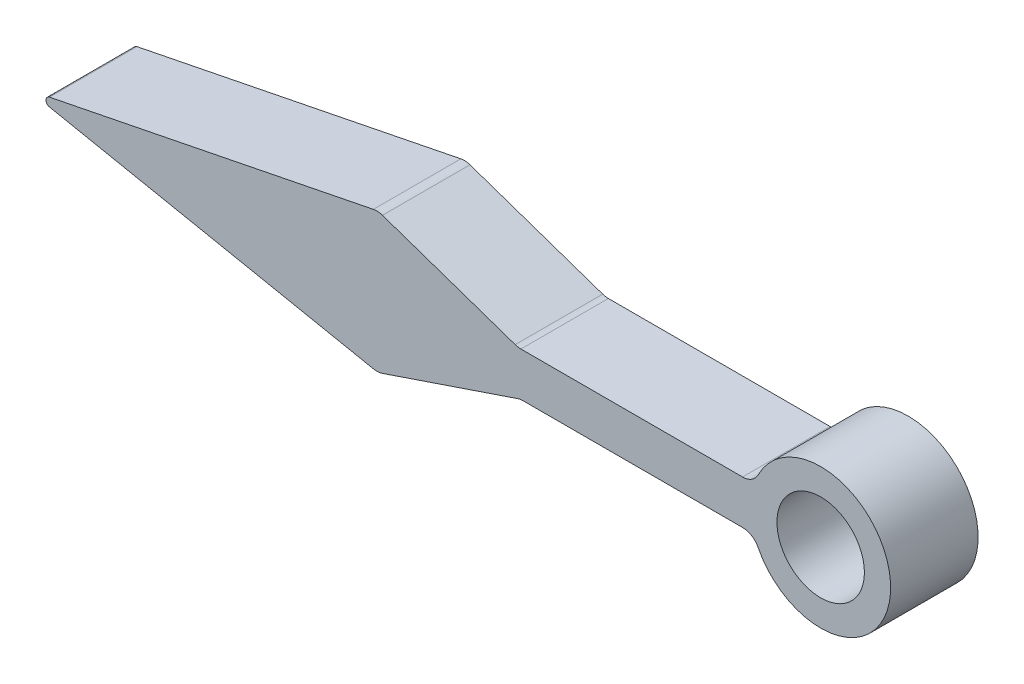
ISO-10303-21;
HEADER;
FILE_DESCRIPTION(('STEP AP214'),'2;1');
FILE_NAME('part.step','',(''),(''),'','','');
FILE_SCHEMA(('AUTOMOTIVE_DESIGN { 1 0 10303 214 1 1 1 1 }'));
ENDSEC;
DATA;
#1=APPLICATION_CONTEXT('core data for automotive mechanical design processes');
#2=APPLICATION_PROTOCOL_DEFINITION('international standard','automotive_design',2000,#1);
#3=PRODUCT_CONTEXT('',#1,'mechanical');
#4=PRODUCT('Part','Part','',(#3));
#5=PRODUCT_RELATED_PRODUCT_CATEGORY('part','',(#4));
#6=PRODUCT_DEFINITION_FORMATION('','',#4);
#7=PRODUCT_DEFINITION_CONTEXT('part definition',#1,'design');
#8=PRODUCT_DEFINITION('design','',#6,#7);
#9=PRODUCT_DEFINITION_SHAPE('','',#8);
#10=(LENGTH_UNIT() NAMED_UNIT(*) SI_UNIT(.MILLI.,.METRE.));
#11=(NAMED_UNIT(*) PLANE_ANGLE_UNIT() SI_UNIT($,.RADIAN.));
#12=(NAMED_UNIT(*) SI_UNIT($,.STERADIAN.) SOLID_ANGLE_UNIT());
#13=UNCERTAINTY_MEASURE_WITH_UNIT(LENGTH_MEASURE(1.E-05),#10,'distance_accuracy_value','');
#14=(GEOMETRIC_REPRESENTATION_CONTEXT(3) GLOBAL_UNCERTAINTY_ASSIGNED_CONTEXT((#13)) GLOBAL_UNIT_ASSIGNED_CONTEXT((#10,
#11,#12)) REPRESENTATION_CONTEXT('',''));
#15=CARTESIAN_POINT('',(0.,0.,0.));
#16=DIRECTION('',(0.,0.,1.));
#17=DIRECTION('',(1.,0.,0.));
#18=AXIS2_PLACEMENT_3D('',#15,#16,#17);
#19=CARTESIAN_POINT('',(0.,0.,5.));
#20=DIRECTION('',(0.,0.,-1.));
#21=DIRECTION('',(-1.,0.,0.));
#22=AXIS2_PLACEMENT_3D('',#19,#20,#21);
#23=PLANE('',#22);
#24=DIRECTION('',(-0.98058067569092,-0.196116135138184,0.));
#25=VECTOR('',#24,1.);
#26=CARTESIAN_POINT('',(-25.2996710383927,4.,5.));
#27=LINE('',#26,#25);
#28=CARTESIAN_POINT('',(-25.5649896875759,3.94693627016336,5.));
#29=VERTEX_POINT('',#28);
#30=CARTESIAN_POINT('',(-44.073945193779,0.245145168922732,5.));
#31=VERTEX_POINT('',#30);
#32=EDGE_CURVE('E194',#29,#31,#27,.T.);
#33=ORIENTED_EDGE('',*,*,#32,.T.);
#34=CARTESIAN_POINT('',(-44.0249161599945,0.,5.));
#35=DIRECTION('',(0.,0.,-1.));
#36=DIRECTION('',(-1.,0.,0.));
#37=AXIS2_PLACEMENT_3D('',#34,#35,#36);
#38=CIRCLE('',#37,0.25);
#39=CARTESIAN_POINT('',(-44.073945193779,-0.245145168922731,5.));
#40=VERTEX_POINT('',#39);
#41=EDGE_CURVE('E12',#31,#40,#38,.F.);
#42=ORIENTED_EDGE('',*,*,#41,.T.);
#43=DIRECTION('',(0.98058067569092,-0.196116135138184,0.));
#44=VECTOR('',#43,1.);
#45=CARTESIAN_POINT('',(-45.2996710383927,0.,5.));
#46=LINE('',#45,#44);
#47=CARTESIAN_POINT('',(-25.5624168385576,-3.94745083996701,5.));
#48=VERTEX_POINT('',#47);
#49=EDGE_CURVE('E192',#40,#48,#46,.T.);
#50=ORIENTED_EDGE('',*,*,#49,.T.);
#51=CARTESIAN_POINT('',(-25.3663007034194,-2.96687016427609,5.));
#52=DIRECTION('',(0.,0.,-1.));
#53=DIRECTION('',(-1.,0.,0.));
#54=AXIS2_PLACEMENT_3D('',#51,#52,#53);
#55=CIRCLE('',#54,1.);
#56=CARTESIAN_POINT('',(-25.0458519206957,-3.91413600745363,5.));
#57=VERTEX_POINT('',#56);
#58=EDGE_CURVE('E222',#48,#57,#55,.F.);
#59=ORIENTED_EDGE('',*,*,#58,.T.);
#60=DIRECTION('',(0.947265843177538,0.320448782723772,0.));
#61=VECTOR('',#60,1.);
#62=CARTESIAN_POINT('',(-25.2996710383927,-4.,5.));
#63=LINE('',#62,#61);
#64=CARTESIAN_POINT('',(-17.3263912477998,-1.30273415682246,5.));
#65=VERTEX_POINT('',#64);
#66=EDGE_CURVE('E299',#57,#65,#63,.T.);
#67=ORIENTED_EDGE('',*,*,#66,.T.);
#68=CARTESIAN_POINT('',(-17.005942465076,-2.25,5.));
#69=DIRECTION('',(0.,0.,-1.));
#70=DIRECTION('',(-1.,0.,0.));
#71=AXIS2_PLACEMENT_3D('',#68,#69,#70);
#72=CIRCLE('',#71,1.);
#73=CARTESIAN_POINT('',(-17.005942465076,-1.25,5.));
#74=VERTEX_POINT('',#73);
#75=EDGE_CURVE('E291',#65,#74,#72,.T.);
#76=ORIENTED_EDGE('',*,*,#75,.T.);
#77=DIRECTION('',(1.,0.,0.));
#78=VECTOR('',#77,1.);
#79=CARTESIAN_POINT('',(-17.1705059137938,-1.25,5.));
#80=LINE('',#79,#78);
#81=CARTESIAN_POINT('',(-4.46514277487294,-1.25,5.));
#82=VERTEX_POINT('',#81);
#83=EDGE_CURVE('E260',#74,#82,#80,.T.);
#84=ORIENTED_EDGE('',*,*,#83,.T.);
#85=CARTESIAN_POINT('',(-4.46514277487294,-2.25,5.));
#86=DIRECTION('',(0.,0.,-1.));
#87=DIRECTION('',(-1.,0.,0.));
#88=AXIS2_PLACEMENT_3D('',#85,#86,#87);
#89=CIRCLE('',#88,1.);
#90=CARTESIAN_POINT('',(-3.57211421989835,-1.8,5.));
#91=VERTEX_POINT('',#90);
#92=EDGE_CURVE('E154',#82,#91,#89,.T.);
#93=ORIENTED_EDGE('',*,*,#92,.T.);
#94=CARTESIAN_POINT('',(0.,0.,5.));
#95=DIRECTION('',(0.,0.,1.));
#96=DIRECTION('',(-1.,0.,0.));
#97=AXIS2_PLACEMENT_3D('',#94,#95,#96);
#98=CIRCLE('',#97,4.);
#99=CARTESIAN_POINT('',(-3.57211421989835,1.8,5.));
#100=VERTEX_POINT('',#99);
#101=EDGE_CURVE('E164',#91,#100,#98,.T.);
#102=ORIENTED_EDGE('',*,*,#101,.T.);
#103=CARTESIAN_POINT('',(-4.46514277487294,2.25,5.));
#104=DIRECTION('',(0.,0.,-1.));
#105=DIRECTION('',(-1.,0.,0.));
#106=AXIS2_PLACEMENT_3D('',#103,#104,#105);
#107=CIRCLE('',#106,1.);
#108=CARTESIAN_POINT('',(-4.46514277487294,1.25,5.));
#109=VERTEX_POINT('',#108);
#110=EDGE_CURVE('E279',#100,#109,#107,.T.);
#111=ORIENTED_EDGE('',*,*,#110,.T.);
#112=DIRECTION('',(-1.,0.,0.));
#113=VECTOR('',#112,1.);
#114=CARTESIAN_POINT('',(-3.79967103839267,1.25,5.));
#115=LINE('',#114,#113);
#116=CARTESIAN_POINT('',(-17.1325938900856,1.25,5.));
#117=VERTEX_POINT('',#116);
#118=EDGE_CURVE('E259',#109,#117,#115,.T.);
#119=ORIENTED_EDGE('',*,*,#118,.T.);
#120=CARTESIAN_POINT('',(-17.1325938900856,2.25,5.));
#121=DIRECTION('',(0.,0.,-1.));
#122=DIRECTION('',(-1.,0.,0.));
#123=AXIS2_PLACEMENT_3D('',#120,#121,#122);
#124=CIRCLE('',#123,1.);
#125=CARTESIAN_POINT('',(-17.4576736585967,1.30431340069513,5.));
#126=VERTEX_POINT('',#125);
#127=EDGE_CURVE('E272',#117,#126,#124,.T.);
#128=ORIENTED_EDGE('',*,*,#127,.T.);
#129=DIRECTION('',(-0.945686599304867,0.325079768511048,0.));
#130=VECTOR('',#129,1.);
#131=CARTESIAN_POINT('',(-17.2996710383927,1.25,5.));
#132=LINE('',#131,#130);
#133=CARTESIAN_POINT('',(-25.0437937839266,3.9120421937773,5.));
#134=VERTEX_POINT('',#133);
#135=EDGE_CURVE('E267',#126,#134,#132,.T.);
#136=ORIENTED_EDGE('',*,*,#135,.T.);
#137=CARTESIAN_POINT('',(-25.3688735524377,2.96635559447244,5.));
#138=DIRECTION('',(0.,0.,-1.));
#139=DIRECTION('',(-1.,0.,0.));
#140=AXIS2_PLACEMENT_3D('',#137,#138,#139);
#141=CIRCLE('',#140,1.);
#142=EDGE_CURVE('E219',#134,#29,#141,.F.);
#143=ORIENTED_EDGE('',*,*,#142,.T.);
#144=EDGE_LOOP('',(#33,#42,#50,#59,#67,#76,#84,#93,#102,#111,#119,#128,#136,#143));
#145=FACE_BOUND('',#144,.T.);
#146=CARTESIAN_POINT('',(0.,0.,5.));
#147=DIRECTION('',(0.,0.,1.));
#148=DIRECTION('',(1.,0.,0.));
#149=AXIS2_PLACEMENT_3D('',#146,#147,#148);
#150=CIRCLE('',#149,2.5);
#151=CARTESIAN_POINT('',(2.5,0.,5.));
#152=VERTEX_POINT('',#151);
#153=EDGE_CURVE('E317',#152,#152,#150,.T.);
#154=ORIENTED_EDGE('',*,*,#153,.F.);
#155=EDGE_LOOP('',(#154));
#156=FACE_BOUND('',#155,.T.);
#157=ADVANCED_FACE('F42',(#145,#156),#23,.F.);
#158=CARTESIAN_POINT('',(0.,0.,0.));
#159=DIRECTION('',(0.,0.,-1.));
#160=DIRECTION('',(-1.,0.,0.));
#161=AXIS2_PLACEMENT_3D('',#158,#159,#160);
#162=PLANE('',#161);
#163=DIRECTION('',(0.98058067569092,-0.196116135138184,0.));
#164=VECTOR('',#163,1.);
#165=CARTESIAN_POINT('',(-45.2996710383927,0.,0.));
#166=LINE('',#165,#164);
#167=CARTESIAN_POINT('',(-44.073945193779,-0.245145168922731,0.));
#168=VERTEX_POINT('',#167);
#169=CARTESIAN_POINT('',(-25.5624168385576,-3.94745083996701,0.));
#170=VERTEX_POINT('',#169);
#171=EDGE_CURVE('E315',#168,#170,#166,.T.);
#172=ORIENTED_EDGE('',*,*,#171,.F.);
#173=CARTESIAN_POINT('',(-44.0249161599945,0.,0.));
#174=DIRECTION('',(0.,0.,-1.));
#175=DIRECTION('',(-1.,0.,0.));
#176=AXIS2_PLACEMENT_3D('',#173,#174,#175);
#177=CIRCLE('',#176,0.25);
#178=CARTESIAN_POINT('',(-44.073945193779,0.245145168922732,0.));
#179=VERTEX_POINT('',#178);
#180=EDGE_CURVE('E65',#168,#179,#177,.T.);
#181=ORIENTED_EDGE('',*,*,#180,.T.);
#182=DIRECTION('',(-0.98058067569092,-0.196116135138184,0.));
#183=VECTOR('',#182,1.);
#184=CARTESIAN_POINT('',(-25.2996710383927,4.,0.));
#185=LINE('',#184,#183);
#186=CARTESIAN_POINT('',(-25.5649896875759,3.94693627016336,0.));
#187=VERTEX_POINT('',#186);
#188=EDGE_CURVE('E189',#187,#179,#185,.T.);
#189=ORIENTED_EDGE('',*,*,#188,.F.);
#190=CARTESIAN_POINT('',(-25.3688735524377,2.96635559447244,0.));
#191=DIRECTION('',(0.,0.,-1.));
#192=DIRECTION('',(-1.,0.,0.));
#193=AXIS2_PLACEMENT_3D('',#190,#191,#192);
#194=CIRCLE('',#193,1.);
#195=CARTESIAN_POINT('',(-25.0437937839266,3.9120421937773,0.));
#196=VERTEX_POINT('',#195);
#197=EDGE_CURVE('E208',#187,#196,#194,.T.);
#198=ORIENTED_EDGE('',*,*,#197,.T.);
#199=DIRECTION('',(-0.945686599304867,0.325079768511048,0.));
#200=VECTOR('',#199,1.);
#201=CARTESIAN_POINT('',(-17.2996710383927,1.25,0.));
#202=LINE('',#201,#200);
#203=CARTESIAN_POINT('',(-17.4576736585967,1.30431340069513,0.));
#204=VERTEX_POINT('',#203);
#205=EDGE_CURVE('E180',#204,#196,#202,.T.);
#206=ORIENTED_EDGE('',*,*,#205,.F.);
#207=CARTESIAN_POINT('',(-17.1325938900856,2.25,0.));
#208=DIRECTION('',(0.,0.,-1.));
#209=DIRECTION('',(-1.,0.,0.));
#210=AXIS2_PLACEMENT_3D('',#207,#208,#209);
#211=CIRCLE('',#210,1.);
#212=CARTESIAN_POINT('',(-17.1325938900856,1.25,0.));
#213=VERTEX_POINT('',#212);
#214=EDGE_CURVE('E277',#204,#213,#211,.F.);
#215=ORIENTED_EDGE('',*,*,#214,.T.);
#216=DIRECTION('',(-1.,0.,0.));
#217=VECTOR('',#216,1.);
#218=CARTESIAN_POINT('',(-3.79967103839267,1.25,0.));
#219=LINE('',#218,#217);
#220=CARTESIAN_POINT('',(-4.46514277487294,1.25,0.));
#221=VERTEX_POINT('',#220);
#222=EDGE_CURVE('E174',#221,#213,#219,.T.);
#223=ORIENTED_EDGE('',*,*,#222,.F.);
#224=CARTESIAN_POINT('',(-4.46514277487294,2.25,0.));
#225=DIRECTION('',(0.,0.,-1.));
#226=DIRECTION('',(-1.,0.,0.));
#227=AXIS2_PLACEMENT_3D('',#224,#225,#226);
#228=CIRCLE('',#227,1.);
#229=CARTESIAN_POINT('',(-3.57211421989835,1.8,0.));
#230=VERTEX_POINT('',#229);
#231=EDGE_CURVE('E172',#221,#230,#228,.F.);
#232=ORIENTED_EDGE('',*,*,#231,.T.);
#233=CARTESIAN_POINT('',(0.,0.,0.));
#234=DIRECTION('',(0.,0.,1.));
#235=DIRECTION('',(-1.,0.,0.));
#236=AXIS2_PLACEMENT_3D('',#233,#234,#235);
#237=CIRCLE('',#236,4.);
#238=CARTESIAN_POINT('',(-3.57211421989835,-1.8,0.));
#239=VERTEX_POINT('',#238);
#240=EDGE_CURVE('E161',#239,#230,#237,.T.);
#241=ORIENTED_EDGE('',*,*,#240,.F.);
#242=CARTESIAN_POINT('',(-4.46514277487294,-2.25,0.));
#243=DIRECTION('',(0.,0.,-1.));
#244=DIRECTION('',(-1.,0.,0.));
#245=AXIS2_PLACEMENT_3D('',#242,#243,#244);
#246=CIRCLE('',#245,1.);
#247=CARTESIAN_POINT('',(-4.46514277487294,-1.25,0.));
#248=VERTEX_POINT('',#247);
#249=EDGE_CURVE('E144',#239,#248,#246,.F.);
#250=ORIENTED_EDGE('',*,*,#249,.T.);
#251=DIRECTION('',(1.,0.,0.));
#252=VECTOR('',#251,1.);
#253=CARTESIAN_POINT('',(-17.1705059137938,-1.25,0.));
#254=LINE('',#253,#252);
#255=CARTESIAN_POINT('',(-17.005942465076,-1.25,0.));
#256=VERTEX_POINT('',#255);
#257=EDGE_CURVE('E175',#256,#248,#254,.T.);
#258=ORIENTED_EDGE('',*,*,#257,.F.);
#259=CARTESIAN_POINT('',(-17.005942465076,-2.25,0.));
#260=DIRECTION('',(0.,0.,-1.));
#261=DIRECTION('',(-1.,0.,0.));
#262=AXIS2_PLACEMENT_3D('',#259,#260,#261);
#263=CIRCLE('',#262,1.);
#264=CARTESIAN_POINT('',(-17.3263912477998,-1.30273415682246,0.));
#265=VERTEX_POINT('',#264);
#266=EDGE_CURVE('E245',#256,#265,#263,.F.);
#267=ORIENTED_EDGE('',*,*,#266,.T.);
#268=DIRECTION('',(0.947265843177538,0.320448782723772,0.));
#269=VECTOR('',#268,1.);
#270=CARTESIAN_POINT('',(-25.2996710383927,-4.,0.));
#271=LINE('',#270,#269);
#272=CARTESIAN_POINT('',(-25.0458519206957,-3.91413600745363,0.));
#273=VERTEX_POINT('',#272);
#274=EDGE_CURVE('E182',#273,#265,#271,.T.);
#275=ORIENTED_EDGE('',*,*,#274,.F.);
#276=CARTESIAN_POINT('',(-25.3663007034194,-2.96687016427609,0.));
#277=DIRECTION('',(0.,0.,-1.));
#278=DIRECTION('',(-1.,0.,0.));
#279=AXIS2_PLACEMENT_3D('',#276,#277,#278);
#280=CIRCLE('',#279,1.);
#281=EDGE_CURVE('E211',#273,#170,#280,.T.);
#282=ORIENTED_EDGE('',*,*,#281,.T.);
#283=EDGE_LOOP('',(#172,#181,#189,#198,#206,#215,#223,#232,#241,#250,#258,#267,#275,#282));
#284=FACE_BOUND('',#283,.T.);
#285=CARTESIAN_POINT('',(0.,0.,0.));
#286=DIRECTION('',(0.,0.,1.));
#287=DIRECTION('',(1.,0.,0.));
#288=AXIS2_PLACEMENT_3D('',#285,#286,#287);
#289=CIRCLE('',#288,2.5);
#290=CARTESIAN_POINT('',(2.5,0.,0.));
#291=VERTEX_POINT('',#290);
#292=EDGE_CURVE('E307',#291,#291,#289,.T.);
#293=ORIENTED_EDGE('',*,*,#292,.T.);
#294=EDGE_LOOP('',(#293));
#295=FACE_BOUND('',#294,.T.);
#296=ADVANCED_FACE('F169',(#284,#295),#162,.T.);
#297=CARTESIAN_POINT('',(-45.2996710383927,0.,5.));
#298=DIRECTION('',(0.196116135138184,0.98058067569092,0.));
#299=DIRECTION('',(-0.98058067569092,0.196116135138184,0.));
#300=AXIS2_PLACEMENT_3D('',#297,#298,#299);
#301=PLANE('',#300);
#302=ORIENTED_EDGE('',*,*,#49,.F.);
#303=DIRECTION('',(0.,0.,-1.));
#304=VECTOR('',#303,1.);
#305=CARTESIAN_POINT('',(-44.073945193779,-0.245145168922731,5.));
#306=LINE('',#305,#304);
#307=EDGE_CURVE('E283',#40,#168,#306,.T.);
#308=ORIENTED_EDGE('',*,*,#307,.T.);
#309=ORIENTED_EDGE('',*,*,#171,.T.);
#310=DIRECTION('',(0.,0.,-1.));
#311=VECTOR('',#310,1.);
#312=CARTESIAN_POINT('',(-25.5624168385576,-3.94745083996701,5.));
#313=LINE('',#312,#311);
#314=EDGE_CURVE('E215',#170,#48,#313,.F.);
#315=ORIENTED_EDGE('',*,*,#314,.T.);
#316=EDGE_LOOP('',(#302,#308,#309,#315));
#317=FACE_BOUND('',#316,.T.);
#318=ADVANCED_FACE('F342',(#317),#301,.F.);
#319=CARTESIAN_POINT('',(-25.2996710383927,-4.,5.));
#320=DIRECTION('',(-0.320448782723772,0.947265843177538,0.));
#321=DIRECTION('',(-0.947265843177538,-0.320448782723772,0.));
#322=AXIS2_PLACEMENT_3D('',#319,#320,#321);
#323=PLANE('',#322);
#324=ORIENTED_EDGE('',*,*,#274,.T.);
#325=DIRECTION('',(0.,0.,-1.));
#326=VECTOR('',#325,1.);
#327=CARTESIAN_POINT('',(-17.3263912477998,-1.30273415682246,5.));
#328=LINE('',#327,#326);
#329=EDGE_CURVE('E205',#265,#65,#328,.F.);
#330=ORIENTED_EDGE('',*,*,#329,.T.);
#331=ORIENTED_EDGE('',*,*,#66,.F.);
#332=DIRECTION('',(0.,0.,-1.));
#333=VECTOR('',#332,1.);
#334=CARTESIAN_POINT('',(-25.0458519206957,-3.91413600745363,5.));
#335=LINE('',#334,#333);
#336=EDGE_CURVE('E201',#57,#273,#335,.T.);
#337=ORIENTED_EDGE('',*,*,#336,.T.);
#338=EDGE_LOOP('',(#324,#330,#331,#337));
#339=FACE_BOUND('',#338,.T.);
#340=ADVANCED_FACE('F323',(#339),#323,.F.);
#341=CARTESIAN_POINT('',(-17.1705059137938,-1.25,5.));
#342=DIRECTION('',(0.,1.,0.));
#343=DIRECTION('',(-1.,0.,0.));
#344=AXIS2_PLACEMENT_3D('',#341,#342,#343);
#345=PLANE('',#344);
#346=ORIENTED_EDGE('',*,*,#257,.T.);
#347=DIRECTION('',(0.,0.,1.));
#348=VECTOR('',#347,1.);
#349=CARTESIAN_POINT('',(-4.46514277487294,-1.25,5.));
#350=LINE('',#349,#348);
#351=EDGE_CURVE('E149',#248,#82,#350,.T.);
#352=ORIENTED_EDGE('',*,*,#351,.T.);
#353=ORIENTED_EDGE('',*,*,#83,.F.);
#354=DIRECTION('',(0.,0.,-1.));
#355=VECTOR('',#354,1.);
#356=CARTESIAN_POINT('',(-17.005942465076,-1.25,0.));
#357=LINE('',#356,#355);
#358=EDGE_CURVE('E166',#74,#256,#357,.T.);
#359=ORIENTED_EDGE('',*,*,#358,.T.);
#360=EDGE_LOOP('',(#346,#352,#353,#359));
#361=FACE_BOUND('',#360,.T.);
#362=ADVANCED_FACE('F333',(#361),#345,.F.);
#363=CARTESIAN_POINT('',(0.,0.,5.));
#364=DIRECTION('',(0.,0.,-1.));
#365=DIRECTION('',(-1.,0.,0.));
#366=AXIS2_PLACEMENT_3D('',#363,#364,#365);
#367=CYLINDRICAL_SURFACE('',#366,4.);
#368=ORIENTED_EDGE('',*,*,#101,.F.);
#369=DIRECTION('',(0.,0.,-1.));
#370=VECTOR('',#369,1.);
#371=CARTESIAN_POINT('',(-3.57211421989835,-1.8,5.));
#372=LINE('',#371,#370);
#373=EDGE_CURVE('E148',#91,#239,#372,.T.);
#374=ORIENTED_EDGE('',*,*,#373,.T.);
#375=ORIENTED_EDGE('',*,*,#240,.T.);
#376=DIRECTION('',(0.,0.,-1.));
#377=VECTOR('',#376,1.);
#378=CARTESIAN_POINT('',(-3.57211421989835,1.8,5.));
#379=LINE('',#378,#377);
#380=EDGE_CURVE('E167',#230,#100,#379,.F.);
#381=ORIENTED_EDGE('',*,*,#380,.T.);
#382=EDGE_LOOP('',(#368,#374,#375,#381));
#383=FACE_BOUND('',#382,.T.);
#384=ADVANCED_FACE('F160',(#383),#367,.T.);
#385=CARTESIAN_POINT('',(-3.79967103839267,1.25,5.));
#386=DIRECTION('',(0.,-1.,0.));
#387=DIRECTION('',(1.,0.,0.));
#388=AXIS2_PLACEMENT_3D('',#385,#386,#387);
#389=PLANE('',#388);
#390=ORIENTED_EDGE('',*,*,#222,.T.);
#391=DIRECTION('',(0.,0.,-1.));
#392=VECTOR('',#391,1.);
#393=CARTESIAN_POINT('',(-17.1325938900856,1.25,5.));
#394=LINE('',#393,#392);
#395=EDGE_CURVE('E155',#213,#117,#394,.F.);
#396=ORIENTED_EDGE('',*,*,#395,.T.);
#397=ORIENTED_EDGE('',*,*,#118,.F.);
#398=DIRECTION('',(0.,0.,1.));
#399=VECTOR('',#398,1.);
#400=CARTESIAN_POINT('',(-4.46514277487294,1.25,0.));
#401=LINE('',#400,#399);
#402=EDGE_CURVE('E236',#109,#221,#401,.F.);
#403=ORIENTED_EDGE('',*,*,#402,.T.);
#404=EDGE_LOOP('',(#390,#396,#397,#403));
#405=FACE_BOUND('',#404,.T.);
#406=ADVANCED_FACE('F340',(#405),#389,.F.);
#407=CARTESIAN_POINT('',(-17.2996710383927,1.25,5.));
#408=DIRECTION('',(-0.325079768511048,-0.945686599304867,0.));
#409=DIRECTION('',(0.945686599304867,-0.325079768511048,0.));
#410=AXIS2_PLACEMENT_3D('',#407,#408,#409);
#411=PLANE('',#410);
#412=ORIENTED_EDGE('',*,*,#205,.T.);
#413=DIRECTION('',(0.,0.,-1.));
#414=VECTOR('',#413,1.);
#415=CARTESIAN_POINT('',(-25.0437937839266,3.9120421937773,5.));
#416=LINE('',#415,#414);
#417=EDGE_CURVE('E233',#196,#134,#416,.F.);
#418=ORIENTED_EDGE('',*,*,#417,.T.);
#419=ORIENTED_EDGE('',*,*,#135,.F.);
#420=DIRECTION('',(0.,0.,-1.));
#421=VECTOR('',#420,1.);
#422=CARTESIAN_POINT('',(-17.4576736585967,1.30431340069513,0.));
#423=LINE('',#422,#421);
#424=EDGE_CURVE('E229',#126,#204,#423,.T.);
#425=ORIENTED_EDGE('',*,*,#424,.T.);
#426=EDGE_LOOP('',(#412,#418,#419,#425));
#427=FACE_BOUND('',#426,.T.);
#428=ADVANCED_FACE('F356',(#427),#411,.F.);
#429=CARTESIAN_POINT('',(-25.2996710383927,4.,5.));
#430=DIRECTION('',(0.196116135138184,-0.98058067569092,0.));
#431=DIRECTION('',(0.98058067569092,0.196116135138184,0.));
#432=AXIS2_PLACEMENT_3D('',#429,#430,#431);
#433=PLANE('',#432);
#434=ORIENTED_EDGE('',*,*,#188,.T.);
#435=DIRECTION('',(0.,0.,-1.));
#436=VECTOR('',#435,1.);
#437=CARTESIAN_POINT('',(-44.073945193779,0.24514516892273,5.));
#438=LINE('',#437,#436);
#439=EDGE_CURVE('E51',#179,#31,#438,.F.);
#440=ORIENTED_EDGE('',*,*,#439,.T.);
#441=ORIENTED_EDGE('',*,*,#32,.F.);
#442=DIRECTION('',(0.,0.,-1.));
#443=VECTOR('',#442,1.);
#444=CARTESIAN_POINT('',(-25.5649896875759,3.94693627016336,5.));
#445=LINE('',#444,#443);
#446=EDGE_CURVE('E225',#29,#187,#445,.T.);
#447=ORIENTED_EDGE('',*,*,#446,.T.);
#448=EDGE_LOOP('',(#434,#440,#441,#447));
#449=FACE_BOUND('',#448,.T.);
#450=ADVANCED_FACE('F353',(#449),#433,.F.);
#451=CARTESIAN_POINT('',(0.,0.,5.));
#452=DIRECTION('',(0.,0.,-1.));
#453=DIRECTION('',(-1.,0.,0.));
#454=AXIS2_PLACEMENT_3D('',#451,#452,#453);
#455=CYLINDRICAL_SURFACE('',#454,2.5);
#456=ORIENTED_EDGE('',*,*,#153,.T.);
#457=EDGE_LOOP('',(#456));
#458=FACE_BOUND('',#457,.T.);
#459=ORIENTED_EDGE('',*,*,#292,.F.);
#460=EDGE_LOOP('',(#459));
#461=FACE_BOUND('',#460,.T.);
#462=ADVANCED_FACE('F351',(#458,#461),#455,.F.);
#463=CARTESIAN_POINT('',(-4.46514277487294,-2.25,5.));
#464=DIRECTION('',(0.,0.,-1.));
#465=DIRECTION('',(-1.,0.,0.));
#466=AXIS2_PLACEMENT_3D('',#463,#464,#465);
#467=CYLINDRICAL_SURFACE('',#466,1.);
#468=ORIENTED_EDGE('',*,*,#92,.F.);
#469=ORIENTED_EDGE('',*,*,#351,.F.);
#470=ORIENTED_EDGE('',*,*,#249,.F.);
#471=ORIENTED_EDGE('',*,*,#373,.F.);
#472=EDGE_LOOP('',(#468,#469,#470,#471));
#473=FACE_BOUND('',#472,.T.);
#474=ADVANCED_FACE('F147',(#473),#467,.F.);
#475=CARTESIAN_POINT('',(-17.005942465076,-2.25,5.));
#476=DIRECTION('',(0.,0.,1.));
#477=DIRECTION('',(1.,0.,0.));
#478=AXIS2_PLACEMENT_3D('',#475,#476,#477);
#479=CYLINDRICAL_SURFACE('',#478,1.);
#480=ORIENTED_EDGE('',*,*,#75,.F.);
#481=ORIENTED_EDGE('',*,*,#329,.F.);
#482=ORIENTED_EDGE('',*,*,#266,.F.);
#483=ORIENTED_EDGE('',*,*,#358,.F.);
#484=EDGE_LOOP('',(#480,#481,#482,#483));
#485=FACE_BOUND('',#484,.T.);
#486=ADVANCED_FACE('F328',(#485),#479,.F.);
#487=CARTESIAN_POINT('',(-25.3663007034194,-2.96687016427609,5.));
#488=DIRECTION('',(0.,0.,-1.));
#489=DIRECTION('',(-1.,0.,0.));
#490=AXIS2_PLACEMENT_3D('',#487,#488,#489);
#491=CYLINDRICAL_SURFACE('',#490,1.);
#492=ORIENTED_EDGE('',*,*,#58,.F.);
#493=ORIENTED_EDGE('',*,*,#314,.F.);
#494=ORIENTED_EDGE('',*,*,#281,.F.);
#495=ORIENTED_EDGE('',*,*,#336,.F.);
#496=EDGE_LOOP('',(#492,#493,#494,#495));
#497=FACE_BOUND('',#496,.T.);
#498=ADVANCED_FACE('F385',(#497),#491,.T.);
#499=CARTESIAN_POINT('',(-25.3688735524377,2.96635559447244,5.));
#500=DIRECTION('',(0.,0.,-1.));
#501=DIRECTION('',(-1.,0.,0.));
#502=AXIS2_PLACEMENT_3D('',#499,#500,#501);
#503=CYLINDRICAL_SURFACE('',#502,1.);
#504=ORIENTED_EDGE('',*,*,#142,.F.);
#505=ORIENTED_EDGE('',*,*,#417,.F.);
#506=ORIENTED_EDGE('',*,*,#197,.F.);
#507=ORIENTED_EDGE('',*,*,#446,.F.);
#508=EDGE_LOOP('',(#504,#505,#506,#507));
#509=FACE_BOUND('',#508,.T.);
#510=ADVANCED_FACE('F376',(#509),#503,.T.);
#511=CARTESIAN_POINT('',(-17.1325938900856,2.25,5.));
#512=DIRECTION('',(0.,0.,1.));
#513=DIRECTION('',(1.,0.,0.));
#514=AXIS2_PLACEMENT_3D('',#511,#512,#513);
#515=CYLINDRICAL_SURFACE('',#514,1.);
#516=ORIENTED_EDGE('',*,*,#127,.F.);
#517=ORIENTED_EDGE('',*,*,#395,.F.);
#518=ORIENTED_EDGE('',*,*,#214,.F.);
#519=ORIENTED_EDGE('',*,*,#424,.F.);
#520=EDGE_LOOP('',(#516,#517,#518,#519));
#521=FACE_BOUND('',#520,.T.);
#522=ADVANCED_FACE('F369',(#521),#515,.F.);
#523=CARTESIAN_POINT('',(-4.46514277487294,2.25,5.));
#524=DIRECTION('',(0.,0.,-1.));
#525=DIRECTION('',(-1.,0.,0.));
#526=AXIS2_PLACEMENT_3D('',#523,#524,#525);
#527=CYLINDRICAL_SURFACE('',#526,1.);
#528=ORIENTED_EDGE('',*,*,#110,.F.);
#529=ORIENTED_EDGE('',*,*,#380,.F.);
#530=ORIENTED_EDGE('',*,*,#231,.F.);
#531=ORIENTED_EDGE('',*,*,#402,.F.);
#532=EDGE_LOOP('',(#528,#529,#530,#531));
#533=FACE_BOUND('',#532,.T.);
#534=ADVANCED_FACE('F397',(#533),#527,.F.);
#535=CARTESIAN_POINT('',(-44.0249161599945,0.,5.));
#536=DIRECTION('',(0.,0.,-1.));
#537=DIRECTION('',(-1.,0.,0.));
#538=AXIS2_PLACEMENT_3D('',#535,#536,#537);
#539=CYLINDRICAL_SURFACE('',#538,0.25);
#540=ORIENTED_EDGE('',*,*,#41,.F.);
#541=ORIENTED_EDGE('',*,*,#439,.F.);
#542=ORIENTED_EDGE('',*,*,#180,.F.);
#543=ORIENTED_EDGE('',*,*,#307,.F.);
#544=EDGE_LOOP('',(#540,#541,#542,#543));
#545=FACE_BOUND('',#544,.T.);
#546=ADVANCED_FACE('F44',(#545),#539,.T.);
#547=CLOSED_SHELL('',(#157,#296,#318,#340,#362,#384,#406,#428,#450,#462,#474,#486,#498,#510,
#522,#534,#546));
#548=MANIFOLD_SOLID_BREP('B2',#547);
#549=ADVANCED_BREP_SHAPE_REPRESENTATION('',(#18,#548),#14);
#550=SHAPE_DEFINITION_REPRESENTATION(#9,#549);
ENDSEC;
END-ISO-10303-21;
